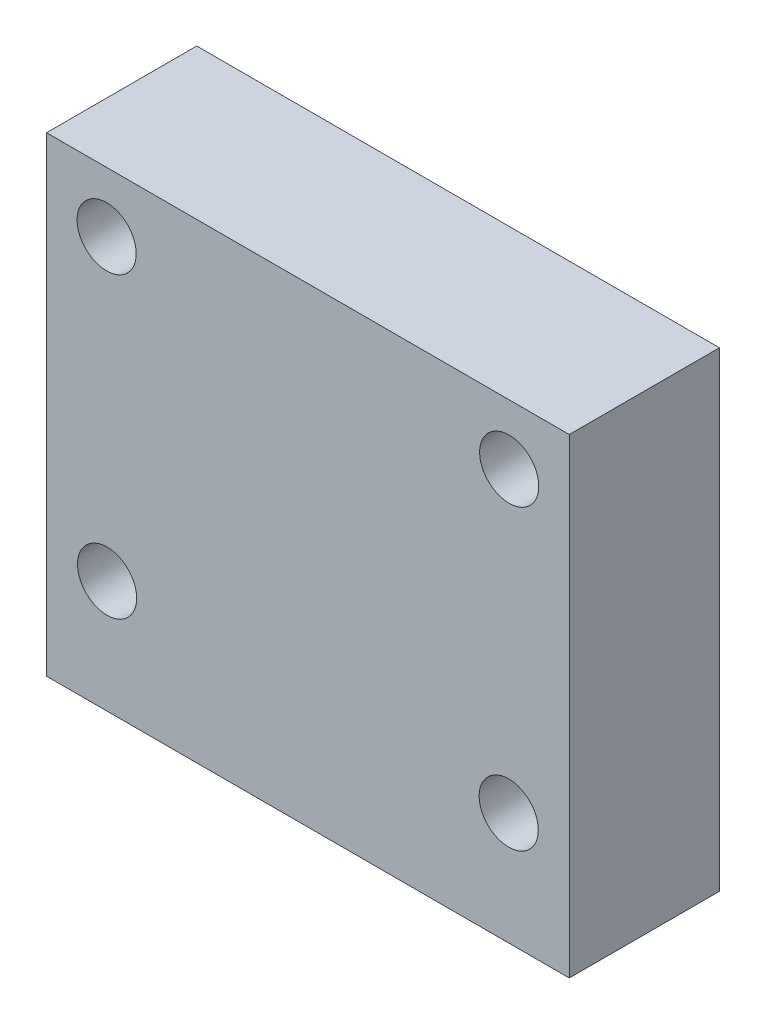
ISO-10303-21;
HEADER;
FILE_DESCRIPTION(('STEP AP214'),'2;1');
FILE_NAME('part.step','',(''),(''),'','','');
FILE_SCHEMA(('AUTOMOTIVE_DESIGN { 1 0 10303 214 1 1 1 1 }'));
ENDSEC;
DATA;
#1=APPLICATION_CONTEXT('core data for automotive mechanical design processes');
#2=APPLICATION_PROTOCOL_DEFINITION('international standard','automotive_design',2000,#1);
#3=PRODUCT_CONTEXT('',#1,'mechanical');
#4=PRODUCT('Part','Part','',(#3));
#5=PRODUCT_RELATED_PRODUCT_CATEGORY('part','',(#4));
#6=PRODUCT_DEFINITION_FORMATION('','',#4);
#7=PRODUCT_DEFINITION_CONTEXT('part definition',#1,'design');
#8=PRODUCT_DEFINITION('design','',#6,#7);
#9=PRODUCT_DEFINITION_SHAPE('','',#8);
#10=(LENGTH_UNIT() NAMED_UNIT(*) SI_UNIT(.MILLI.,.METRE.));
#11=(NAMED_UNIT(*) PLANE_ANGLE_UNIT() SI_UNIT($,.RADIAN.));
#12=(NAMED_UNIT(*) SI_UNIT($,.STERADIAN.) SOLID_ANGLE_UNIT());
#13=UNCERTAINTY_MEASURE_WITH_UNIT(LENGTH_MEASURE(1.E-05),#10,'distance_accuracy_value','');
#14=(GEOMETRIC_REPRESENTATION_CONTEXT(3) GLOBAL_UNCERTAINTY_ASSIGNED_CONTEXT((#13)) GLOBAL_UNIT_ASSIGNED_CONTEXT((#10,
#11,#12)) REPRESENTATION_CONTEXT('',''));
#15=CARTESIAN_POINT('',(0.,0.,0.));
#16=DIRECTION('',(0.,0.,1.));
#17=DIRECTION('',(1.,0.,0.));
#18=AXIS2_PLACEMENT_3D('',#15,#16,#17);
#19=CARTESIAN_POINT('',(11.05,-9.95,3.175));
#20=DIRECTION('',(-1.,0.,0.));
#21=DIRECTION('',(0.,0.,1.));
#22=AXIS2_PLACEMENT_3D('',#19,#20,#21);
#23=PLANE('',#22);
#24=DIRECTION('',(0.,1.,0.));
#25=VECTOR('',#24,1.);
#26=CARTESIAN_POINT('',(11.05,-9.95,-3.175));
#27=LINE('',#26,#25);
#28=CARTESIAN_POINT('',(11.05,-9.95,-3.175));
#29=VERTEX_POINT('',#28);
#30=CARTESIAN_POINT('',(11.05,9.95,-3.175));
#31=VERTEX_POINT('',#30);
#32=EDGE_CURVE('E94',#29,#31,#27,.T.);
#33=ORIENTED_EDGE('',*,*,#32,.T.);
#34=DIRECTION('',(0.,0.,-1.));
#35=VECTOR('',#34,1.);
#36=CARTESIAN_POINT('',(11.05,9.95,3.175));
#37=LINE('',#36,#35);
#38=CARTESIAN_POINT('',(11.05,9.95,3.175));
#39=VERTEX_POINT('',#38);
#40=EDGE_CURVE('E11',#39,#31,#37,.T.);
#41=ORIENTED_EDGE('',*,*,#40,.F.);
#42=DIRECTION('',(0.,1.,0.));
#43=VECTOR('',#42,1.);
#44=CARTESIAN_POINT('',(11.05,-9.95,3.175));
#45=LINE('',#44,#43);
#46=CARTESIAN_POINT('',(11.05,-9.95,3.175));
#47=VERTEX_POINT('',#46);
#48=EDGE_CURVE('E82',#47,#39,#45,.T.);
#49=ORIENTED_EDGE('',*,*,#48,.F.);
#50=DIRECTION('',(0.,0.,-1.));
#51=VECTOR('',#50,1.);
#52=CARTESIAN_POINT('',(11.05,-9.95,3.175));
#53=LINE('',#52,#51);
#54=EDGE_CURVE('E90',#47,#29,#53,.T.);
#55=ORIENTED_EDGE('',*,*,#54,.T.);
#56=EDGE_LOOP('',(#33,#41,#49,#55));
#57=FACE_BOUND('',#56,.T.);
#58=ADVANCED_FACE('F31',(#57),#23,.F.);
#59=CARTESIAN_POINT('',(-11.05,9.95,3.175));
#60=DIRECTION('',(0.,-1.,0.));
#61=DIRECTION('',(0.,0.,-1.));
#62=AXIS2_PLACEMENT_3D('',#59,#60,#61);
#63=PLANE('',#62);
#64=DIRECTION('',(-1.,0.,0.));
#65=VECTOR('',#64,1.);
#66=CARTESIAN_POINT('',(-11.05,9.95,-3.175));
#67=LINE('',#66,#65);
#68=CARTESIAN_POINT('',(-11.05,9.95,-3.175));
#69=VERTEX_POINT('',#68);
#70=EDGE_CURVE('E86',#31,#69,#67,.T.);
#71=ORIENTED_EDGE('',*,*,#70,.T.);
#72=DIRECTION('',(0.,0.,-1.));
#73=VECTOR('',#72,1.);
#74=CARTESIAN_POINT('',(-11.05,9.95,3.175));
#75=LINE('',#74,#73);
#76=CARTESIAN_POINT('',(-11.05,9.95,3.175));
#77=VERTEX_POINT('',#76);
#78=EDGE_CURVE('E39',#77,#69,#75,.T.);
#79=ORIENTED_EDGE('',*,*,#78,.F.);
#80=DIRECTION('',(-1.,0.,0.));
#81=VECTOR('',#80,1.);
#82=CARTESIAN_POINT('',(-11.05,9.95,3.175));
#83=LINE('',#82,#81);
#84=EDGE_CURVE('E77',#39,#77,#83,.T.);
#85=ORIENTED_EDGE('',*,*,#84,.F.);
#86=ORIENTED_EDGE('',*,*,#40,.T.);
#87=EDGE_LOOP('',(#71,#79,#85,#86));
#88=FACE_BOUND('',#87,.T.);
#89=ADVANCED_FACE('F85',(#88),#63,.F.);
#90=CARTESIAN_POINT('',(-11.05,-9.95,3.175));
#91=DIRECTION('',(1.,0.,0.));
#92=DIRECTION('',(0.,0.,-1.));
#93=AXIS2_PLACEMENT_3D('',#90,#91,#92);
#94=PLANE('',#93);
#95=DIRECTION('',(0.,-1.,0.));
#96=VECTOR('',#95,1.);
#97=CARTESIAN_POINT('',(-11.05,-9.95,-3.175));
#98=LINE('',#97,#96);
#99=CARTESIAN_POINT('',(-11.05,-9.95,-3.175));
#100=VERTEX_POINT('',#99);
#101=EDGE_CURVE('E64',#69,#100,#98,.T.);
#102=ORIENTED_EDGE('',*,*,#101,.T.);
#103=DIRECTION('',(0.,0.,-1.));
#104=VECTOR('',#103,1.);
#105=CARTESIAN_POINT('',(-11.05,-9.95,3.175));
#106=LINE('',#105,#104);
#107=CARTESIAN_POINT('',(-11.05,-9.95,3.175));
#108=VERTEX_POINT('',#107);
#109=EDGE_CURVE('E87',#108,#100,#106,.T.);
#110=ORIENTED_EDGE('',*,*,#109,.F.);
#111=DIRECTION('',(0.,-1.,0.));
#112=VECTOR('',#111,1.);
#113=CARTESIAN_POINT('',(-11.05,-9.95,3.175));
#114=LINE('',#113,#112);
#115=EDGE_CURVE('E80',#77,#108,#114,.T.);
#116=ORIENTED_EDGE('',*,*,#115,.F.);
#117=ORIENTED_EDGE('',*,*,#78,.T.);
#118=EDGE_LOOP('',(#102,#110,#116,#117));
#119=FACE_BOUND('',#118,.T.);
#120=ADVANCED_FACE('F88',(#119),#94,.F.);
#121=CARTESIAN_POINT('',(-11.05,-9.95,3.175));
#122=DIRECTION('',(0.,1.,0.));
#123=DIRECTION('',(0.,0.,1.));
#124=AXIS2_PLACEMENT_3D('',#121,#122,#123);
#125=PLANE('',#124);
#126=CARTESIAN_POINT('',(0.,-9.95,0.));
#127=DIRECTION('',(0.,-1.,0.));
#128=DIRECTION('',(0.,0.,-1.));
#129=AXIS2_PLACEMENT_3D('',#126,#127,#128);
#130=CIRCLE('',#129,1.03251);
#131=CARTESIAN_POINT('',(0.,-9.95,-1.03251));
#132=VERTEX_POINT('',#131);
#133=EDGE_CURVE('E108',#132,#132,#130,.T.);
#134=ORIENTED_EDGE('',*,*,#133,.F.);
#135=EDGE_LOOP('',(#134));
#136=FACE_BOUND('',#135,.T.);
#137=DIRECTION('',(1.,0.,0.));
#138=VECTOR('',#137,1.);
#139=CARTESIAN_POINT('',(-11.05,-9.95,-3.175));
#140=LINE('',#139,#138);
#141=EDGE_CURVE('E70',#100,#29,#140,.T.);
#142=ORIENTED_EDGE('',*,*,#141,.T.);
#143=ORIENTED_EDGE('',*,*,#54,.F.);
#144=DIRECTION('',(1.,0.,0.));
#145=VECTOR('',#144,1.);
#146=CARTESIAN_POINT('',(-11.05,-9.95,3.175));
#147=LINE('',#146,#145);
#148=EDGE_CURVE('E47',#108,#47,#147,.T.);
#149=ORIENTED_EDGE('',*,*,#148,.F.);
#150=ORIENTED_EDGE('',*,*,#109,.T.);
#151=EDGE_LOOP('',(#142,#143,#149,#150));
#152=FACE_BOUND('',#151,.T.);
#153=ADVANCED_FACE('F102',(#136,#152),#125,.F.);
#154=CARTESIAN_POINT('',(11.05,9.95,3.175));
#155=DIRECTION('',(0.,0.,-1.));
#156=DIRECTION('',(-1.,0.,0.));
#157=AXIS2_PLACEMENT_3D('',#154,#155,#156);
#158=PLANE('',#157);
#159=CARTESIAN_POINT('',(-8.49,-5.19000000000001,3.175));
#160=DIRECTION('',(0.,0.,1.));
#161=DIRECTION('',(1.,0.,0.));
#162=AXIS2_PLACEMENT_3D('',#159,#160,#161);
#163=CIRCLE('',#162,1.25);
#164=CARTESIAN_POINT('',(-7.24,-5.19000000000001,3.175));
#165=VERTEX_POINT('',#164);
#166=EDGE_CURVE('E132',#165,#165,#163,.T.);
#167=ORIENTED_EDGE('',*,*,#166,.F.);
#168=EDGE_LOOP('',(#167));
#169=FACE_BOUND('',#168,.T.);
#170=CARTESIAN_POINT('',(8.51,7.41,3.175));
#171=DIRECTION('',(0.,0.,1.));
#172=DIRECTION('',(1.,0.,0.));
#173=AXIS2_PLACEMENT_3D('',#170,#171,#172);
#174=CIRCLE('',#173,1.25);
#175=CARTESIAN_POINT('',(9.76,7.41,3.175));
#176=VERTEX_POINT('',#175);
#177=EDGE_CURVE('E126',#176,#176,#174,.T.);
#178=ORIENTED_EDGE('',*,*,#177,.F.);
#179=EDGE_LOOP('',(#178));
#180=FACE_BOUND('',#179,.T.);
#181=CARTESIAN_POINT('',(-8.51,7.41,3.175));
#182=DIRECTION('',(0.,0.,1.));
#183=DIRECTION('',(1.,0.,0.));
#184=AXIS2_PLACEMENT_3D('',#181,#182,#183);
#185=CIRCLE('',#184,1.25);
#186=CARTESIAN_POINT('',(-7.26,7.41,3.175));
#187=VERTEX_POINT('',#186);
#188=EDGE_CURVE('E120',#187,#187,#185,.T.);
#189=ORIENTED_EDGE('',*,*,#188,.F.);
#190=EDGE_LOOP('',(#189));
#191=FACE_BOUND('',#190,.T.);
#192=CARTESIAN_POINT('',(8.49,-5.19,3.175));
#193=DIRECTION('',(0.,0.,1.));
#194=DIRECTION('',(1.,0.,0.));
#195=AXIS2_PLACEMENT_3D('',#192,#193,#194);
#196=CIRCLE('',#195,1.25);
#197=CARTESIAN_POINT('',(9.74,-5.19,3.175));
#198=VERTEX_POINT('',#197);
#199=EDGE_CURVE('E114',#198,#198,#196,.T.);
#200=ORIENTED_EDGE('',*,*,#199,.F.);
#201=EDGE_LOOP('',(#200));
#202=FACE_BOUND('',#201,.T.);
#203=ORIENTED_EDGE('',*,*,#48,.T.);
#204=ORIENTED_EDGE('',*,*,#84,.T.);
#205=ORIENTED_EDGE('',*,*,#115,.T.);
#206=ORIENTED_EDGE('',*,*,#148,.T.);
#207=EDGE_LOOP('',(#203,#204,#205,#206));
#208=FACE_BOUND('',#207,.T.);
#209=ADVANCED_FACE('F78',(#169,#180,#191,#202,#208),#158,.F.);
#210=CARTESIAN_POINT('',(11.05,9.95,-3.175));
#211=DIRECTION('',(0.,0.,-1.));
#212=DIRECTION('',(-1.,0.,0.));
#213=AXIS2_PLACEMENT_3D('',#210,#211,#212);
#214=PLANE('',#213);
#215=CARTESIAN_POINT('',(-8.49,-5.19000000000001,-3.175));
#216=DIRECTION('',(0.,0.,1.));
#217=DIRECTION('',(1.,0.,0.));
#218=AXIS2_PLACEMENT_3D('',#215,#216,#217);
#219=CIRCLE('',#218,1.25);
#220=CARTESIAN_POINT('',(-7.24,-5.19000000000001,-3.175));
#221=VERTEX_POINT('',#220);
#222=EDGE_CURVE('E129',#221,#221,#219,.T.);
#223=ORIENTED_EDGE('',*,*,#222,.T.);
#224=EDGE_LOOP('',(#223));
#225=FACE_BOUND('',#224,.T.);
#226=CARTESIAN_POINT('',(8.51,7.41,-3.175));
#227=DIRECTION('',(0.,0.,1.));
#228=DIRECTION('',(1.,0.,0.));
#229=AXIS2_PLACEMENT_3D('',#226,#227,#228);
#230=CIRCLE('',#229,1.25);
#231=CARTESIAN_POINT('',(9.76,7.41,-3.175));
#232=VERTEX_POINT('',#231);
#233=EDGE_CURVE('E123',#232,#232,#230,.T.);
#234=ORIENTED_EDGE('',*,*,#233,.T.);
#235=EDGE_LOOP('',(#234));
#236=FACE_BOUND('',#235,.T.);
#237=CARTESIAN_POINT('',(-8.51,7.41,-3.175));
#238=DIRECTION('',(0.,0.,1.));
#239=DIRECTION('',(1.,0.,0.));
#240=AXIS2_PLACEMENT_3D('',#237,#238,#239);
#241=CIRCLE('',#240,1.25);
#242=CARTESIAN_POINT('',(-7.26,7.41,-3.175));
#243=VERTEX_POINT('',#242);
#244=EDGE_CURVE('E117',#243,#243,#241,.T.);
#245=ORIENTED_EDGE('',*,*,#244,.T.);
#246=EDGE_LOOP('',(#245));
#247=FACE_BOUND('',#246,.T.);
#248=CARTESIAN_POINT('',(8.49,-5.19,-3.175));
#249=DIRECTION('',(0.,0.,1.));
#250=DIRECTION('',(1.,0.,0.));
#251=AXIS2_PLACEMENT_3D('',#248,#249,#250);
#252=CIRCLE('',#251,1.25);
#253=CARTESIAN_POINT('',(9.74,-5.19,-3.175));
#254=VERTEX_POINT('',#253);
#255=EDGE_CURVE('E111',#254,#254,#252,.T.);
#256=ORIENTED_EDGE('',*,*,#255,.T.);
#257=EDGE_LOOP('',(#256));
#258=FACE_BOUND('',#257,.T.);
#259=ORIENTED_EDGE('',*,*,#32,.F.);
#260=ORIENTED_EDGE('',*,*,#141,.F.);
#261=ORIENTED_EDGE('',*,*,#101,.F.);
#262=ORIENTED_EDGE('',*,*,#70,.F.);
#263=EDGE_LOOP('',(#259,#260,#261,#262));
#264=FACE_BOUND('',#263,.T.);
#265=ADVANCED_FACE('F105',(#225,#236,#247,#258,#264),#214,.T.);
#266=CARTESIAN_POINT('',(0.,2.75,0.));
#267=DIRECTION('',(0.,-1.,0.));
#268=DIRECTION('',(0.,0.,-1.));
#269=AXIS2_PLACEMENT_3D('',#266,#267,#268);
#270=CYLINDRICAL_SURFACE('',#269,1.03251);
#271=CARTESIAN_POINT('',(0.,2.75,0.));
#272=DIRECTION('',(0.,-1.,0.));
#273=DIRECTION('',(0.,0.,-1.));
#274=AXIS2_PLACEMENT_3D('',#271,#272,#273);
#275=CIRCLE('',#274,1.03251);
#276=CARTESIAN_POINT('',(0.,2.75,-1.03251));
#277=VERTEX_POINT('',#276);
#278=EDGE_CURVE('E97',#277,#277,#275,.T.);
#279=ORIENTED_EDGE('',*,*,#278,.F.);
#280=EDGE_LOOP('',(#279));
#281=FACE_BOUND('',#280,.T.);
#282=ORIENTED_EDGE('',*,*,#133,.T.);
#283=EDGE_LOOP('',(#282));
#284=FACE_BOUND('',#283,.T.);
#285=ADVANCED_FACE('F168',(#281,#284),#270,.F.);
#286=CARTESIAN_POINT('',(0.,2.75,0.));
#287=DIRECTION('',(0.,-1.,0.));
#288=DIRECTION('',(0.,0.,-1.));
#289=AXIS2_PLACEMENT_3D('',#286,#287,#288);
#290=PLANE('',#289);
#291=ORIENTED_EDGE('',*,*,#278,.T.);
#292=EDGE_LOOP('',(#291));
#293=FACE_BOUND('',#292,.T.);
#294=ADVANCED_FACE('F159',(#293),#290,.T.);
#295=CARTESIAN_POINT('',(8.49,-5.19,-3.175));
#296=DIRECTION('',(0.,0.,1.));
#297=DIRECTION('',(1.,0.,0.));
#298=AXIS2_PLACEMENT_3D('',#295,#296,#297);
#299=CYLINDRICAL_SURFACE('',#298,1.25);
#300=ORIENTED_EDGE('',*,*,#255,.F.);
#301=EDGE_LOOP('',(#300));
#302=FACE_BOUND('',#301,.T.);
#303=ORIENTED_EDGE('',*,*,#199,.T.);
#304=EDGE_LOOP('',(#303));
#305=FACE_BOUND('',#304,.T.);
#306=ADVANCED_FACE('F156',(#302,#305),#299,.F.);
#307=CARTESIAN_POINT('',(-8.51,7.41,-3.175));
#308=DIRECTION('',(0.,0.,1.));
#309=DIRECTION('',(1.,0.,0.));
#310=AXIS2_PLACEMENT_3D('',#307,#308,#309);
#311=CYLINDRICAL_SURFACE('',#310,1.25);
#312=ORIENTED_EDGE('',*,*,#244,.F.);
#313=EDGE_LOOP('',(#312));
#314=FACE_BOUND('',#313,.T.);
#315=ORIENTED_EDGE('',*,*,#188,.T.);
#316=EDGE_LOOP('',(#315));
#317=FACE_BOUND('',#316,.T.);
#318=ADVANCED_FACE('F158',(#314,#317),#311,.F.);
#319=CARTESIAN_POINT('',(8.51,7.41,-3.175));
#320=DIRECTION('',(0.,0.,1.));
#321=DIRECTION('',(1.,0.,0.));
#322=AXIS2_PLACEMENT_3D('',#319,#320,#321);
#323=CYLINDRICAL_SURFACE('',#322,1.25);
#324=ORIENTED_EDGE('',*,*,#233,.F.);
#325=EDGE_LOOP('',(#324));
#326=FACE_BOUND('',#325,.T.);
#327=ORIENTED_EDGE('',*,*,#177,.T.);
#328=EDGE_LOOP('',(#327));
#329=FACE_BOUND('',#328,.T.);
#330=ADVANCED_FACE('F143',(#326,#329),#323,.F.);
#331=CARTESIAN_POINT('',(-8.49,-5.19000000000001,-3.175));
#332=DIRECTION('',(0.,0.,1.));
#333=DIRECTION('',(1.,0.,0.));
#334=AXIS2_PLACEMENT_3D('',#331,#332,#333);
#335=CYLINDRICAL_SURFACE('',#334,1.25);
#336=ORIENTED_EDGE('',*,*,#222,.F.);
#337=EDGE_LOOP('',(#336));
#338=FACE_BOUND('',#337,.T.);
#339=ORIENTED_EDGE('',*,*,#166,.T.);
#340=EDGE_LOOP('',(#339));
#341=FACE_BOUND('',#340,.T.);
#342=ADVANCED_FACE('F140',(#338,#341),#335,.F.);
#343=CLOSED_SHELL('',(#58,#89,#120,#153,#209,#265,#285,#294,#306,#318,#330,#342));
#344=MANIFOLD_SOLID_BREP('B2',#343);
#345=ADVANCED_BREP_SHAPE_REPRESENTATION('',(#18,#344),#14);
#346=SHAPE_DEFINITION_REPRESENTATION(#9,#345);
ENDSEC;
END-ISO-10303-21;
